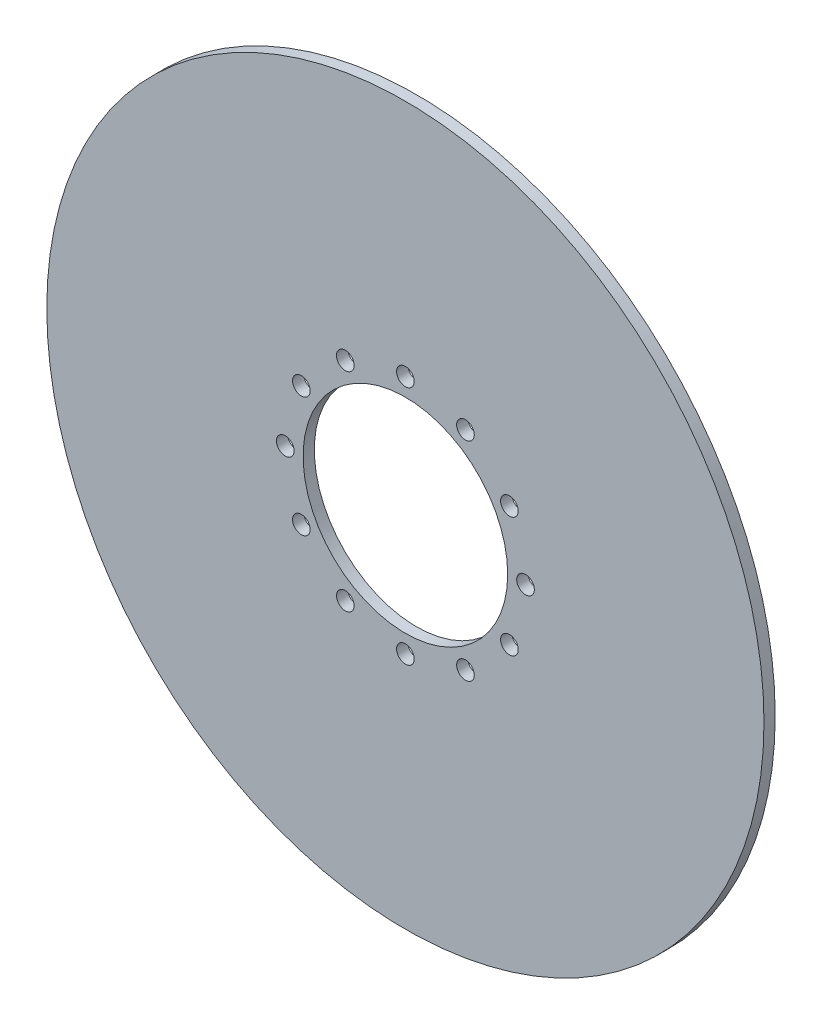
ISO-10303-21;
HEADER;
FILE_DESCRIPTION(('STEP AP214'),'2;1');
FILE_NAME('part.step','',(''),(''),'','','');
FILE_SCHEMA(('AUTOMOTIVE_DESIGN { 1 0 10303 214 1 1 1 1 }'));
ENDSEC;
DATA;
#1=APPLICATION_CONTEXT('core data for automotive mechanical design processes');
#2=APPLICATION_PROTOCOL_DEFINITION('international standard','automotive_design',2000,#1);
#3=PRODUCT_CONTEXT('',#1,'mechanical');
#4=PRODUCT('Part','Part','',(#3));
#5=PRODUCT_RELATED_PRODUCT_CATEGORY('part','',(#4));
#6=PRODUCT_DEFINITION_FORMATION('','',#4);
#7=PRODUCT_DEFINITION_CONTEXT('part definition',#1,'design');
#8=PRODUCT_DEFINITION('design','',#6,#7);
#9=PRODUCT_DEFINITION_SHAPE('','',#8);
#10=(LENGTH_UNIT() NAMED_UNIT(*) SI_UNIT(.MILLI.,.METRE.));
#11=(NAMED_UNIT(*) PLANE_ANGLE_UNIT() SI_UNIT($,.RADIAN.));
#12=(NAMED_UNIT(*) SI_UNIT($,.STERADIAN.) SOLID_ANGLE_UNIT());
#13=UNCERTAINTY_MEASURE_WITH_UNIT(LENGTH_MEASURE(1.E-05),#10,'distance_accuracy_value','');
#14=(GEOMETRIC_REPRESENTATION_CONTEXT(3) GLOBAL_UNCERTAINTY_ASSIGNED_CONTEXT((#13)) GLOBAL_UNIT_ASSIGNED_CONTEXT((#10,
#11,#12)) REPRESENTATION_CONTEXT('',''));
#15=CARTESIAN_POINT('',(0.,0.,0.));
#16=DIRECTION('',(0.,0.,1.));
#17=DIRECTION('',(1.,0.,0.));
#18=AXIS2_PLACEMENT_3D('',#15,#16,#17);
#19=CARTESIAN_POINT('',(0.,0.,3.175));
#20=DIRECTION('',(0.,0.,1.));
#21=DIRECTION('',(1.,0.,0.));
#22=AXIS2_PLACEMENT_3D('',#19,#20,#21);
#23=PLANE('',#22);
#24=CARTESIAN_POINT('',(-29.4448637286702,16.9999999999987,3.175));
#25=DIRECTION('',(0.,0.,1.));
#26=DIRECTION('',(1.,0.,0.));
#27=AXIS2_PLACEMENT_3D('',#24,#25,#26);
#28=CIRCLE('',#27,2.49698906987796);
#29=CARTESIAN_POINT('',(-26.9478746587923,16.9999999999987,3.175));
#30=VERTEX_POINT('',#29);
#31=EDGE_CURVE('E110',#30,#30,#28,.T.);
#32=ORIENTED_EDGE('',*,*,#31,.F.);
#33=EDGE_LOOP('',(#32));
#34=FACE_BOUND('',#33,.T.);
#35=CARTESIAN_POINT('',(-29.4448637286688,-17.0000000000013,3.175));
#36=DIRECTION('',(0.,0.,1.));
#37=DIRECTION('',(1.,0.,0.));
#38=AXIS2_PLACEMENT_3D('',#35,#36,#37);
#39=CIRCLE('',#38,2.49698906987796);
#40=CARTESIAN_POINT('',(-26.9478746587908,-17.0000000000013,3.175));
#41=VERTEX_POINT('',#40);
#42=EDGE_CURVE('E98',#41,#41,#39,.T.);
#43=ORIENTED_EDGE('',*,*,#42,.F.);
#44=EDGE_LOOP('',(#43));
#45=FACE_BOUND('',#44,.T.);
#46=CARTESIAN_POINT('',(2.86804195578331E-12,-34.,3.175));
#47=DIRECTION('',(0.,0.,1.));
#48=DIRECTION('',(1.,0.,0.));
#49=AXIS2_PLACEMENT_3D('',#46,#47,#48);
#50=CIRCLE('',#49,2.49698906987796);
#51=CARTESIAN_POINT('',(2.49698906988083,-34.,3.175));
#52=VERTEX_POINT('',#51);
#53=EDGE_CURVE('E86',#52,#52,#50,.T.);
#54=ORIENTED_EDGE('',*,*,#53,.F.);
#55=EDGE_LOOP('',(#54));
#56=FACE_BOUND('',#55,.T.);
#57=CARTESIAN_POINT('',(29.4448637286731,-16.9999999999988,3.175));
#58=DIRECTION('',(0.,0.,1.));
#59=DIRECTION('',(1.,0.,0.));
#60=AXIS2_PLACEMENT_3D('',#57,#58,#59);
#61=CIRCLE('',#60,2.49698906987769);
#62=CARTESIAN_POINT('',(31.9418527985508,-16.9999999999988,3.175));
#63=VERTEX_POINT('',#62);
#64=EDGE_CURVE('E74',#63,#63,#61,.T.);
#65=ORIENTED_EDGE('',*,*,#64,.F.);
#66=EDGE_LOOP('',(#65));
#67=FACE_BOUND('',#66,.T.);
#68=CARTESIAN_POINT('',(29.4448637286716,17.0000000000012,3.175));
#69=DIRECTION('',(0.,0.,1.));
#70=DIRECTION('',(1.,0.,0.));
#71=AXIS2_PLACEMENT_3D('',#68,#69,#70);
#72=CIRCLE('',#71,2.49698906987796);
#73=CARTESIAN_POINT('',(31.9418527985496,17.0000000000012,3.175));
#74=VERTEX_POINT('',#73);
#75=EDGE_CURVE('E62',#74,#74,#72,.T.);
#76=ORIENTED_EDGE('',*,*,#75,.F.);
#77=EDGE_LOOP('',(#76));
#78=FACE_BOUND('',#77,.T.);
#79=CARTESIAN_POINT('',(0.,34.,3.175));
#80=DIRECTION('',(0.,0.,1.));
#81=DIRECTION('',(1.,0.,0.));
#82=AXIS2_PLACEMENT_3D('',#79,#80,#81);
#83=CIRCLE('',#82,2.49698906987796);
#84=CARTESIAN_POINT('',(2.49698906987796,34.,3.175));
#85=VERTEX_POINT('',#84);
#86=EDGE_CURVE('E50',#85,#85,#83,.T.);
#87=ORIENTED_EDGE('',*,*,#86,.F.);
#88=EDGE_LOOP('',(#87));
#89=FACE_BOUND('',#88,.T.);
#90=CARTESIAN_POINT('',(0.,0.,3.175));
#91=DIRECTION('',(0.,0.,1.));
#92=DIRECTION('',(1.,0.,0.));
#93=AXIS2_PLACEMENT_3D('',#90,#91,#92);
#94=CIRCLE('',#93,101.5);
#95=CARTESIAN_POINT('',(101.5,0.,3.175));
#96=VERTEX_POINT('',#95);
#97=EDGE_CURVE('E10',#96,#96,#94,.T.);
#98=ORIENTED_EDGE('',*,*,#97,.T.);
#99=EDGE_LOOP('',(#98));
#100=FACE_BOUND('',#99,.T.);
#101=CARTESIAN_POINT('',(0.,0.,3.175));
#102=DIRECTION('',(0.,0.,1.));
#103=DIRECTION('',(1.,0.,0.));
#104=AXIS2_PLACEMENT_3D('',#101,#102,#103);
#105=CIRCLE('',#104,28.956);
#106=CARTESIAN_POINT('',(28.956,0.,3.175));
#107=VERTEX_POINT('',#106);
#108=EDGE_CURVE('E45',#107,#107,#105,.T.);
#109=ORIENTED_EDGE('',*,*,#108,.F.);
#110=EDGE_LOOP('',(#109));
#111=FACE_BOUND('',#110,.T.);
#112=CARTESIAN_POINT('',(17.0000000000002,29.4448637286716,3.175));
#113=DIRECTION('',(0.,0.,1.));
#114=DIRECTION('',(1.,0.,0.));
#115=AXIS2_PLACEMENT_3D('',#112,#113,#114);
#116=CIRCLE('',#115,2.49698906987796);
#117=CARTESIAN_POINT('',(19.4969890698782,29.4448637286716,3.175));
#118=VERTEX_POINT('',#117);
#119=EDGE_CURVE('E56',#118,#118,#116,.T.);
#120=ORIENTED_EDGE('',*,*,#119,.F.);
#121=EDGE_LOOP('',(#120));
#122=FACE_BOUND('',#121,.T.);
#123=CARTESIAN_POINT('',(34.0000000000014,1.43402097789165E-12,3.175));
#124=DIRECTION('',(0.,0.,1.));
#125=DIRECTION('',(1.,0.,0.));
#126=AXIS2_PLACEMENT_3D('',#123,#124,#125);
#127=CIRCLE('',#126,2.49698906987796);
#128=CARTESIAN_POINT('',(36.4969890698794,1.43402097789165E-12,3.175));
#129=VERTEX_POINT('',#128);
#130=EDGE_CURVE('E68',#129,#129,#127,.T.);
#131=ORIENTED_EDGE('',*,*,#130,.F.);
#132=EDGE_LOOP('',(#131));
#133=FACE_BOUND('',#132,.T.);
#134=CARTESIAN_POINT('',(17.0000000000027,-29.4448637286702,3.175));
#135=DIRECTION('',(0.,0.,1.));
#136=DIRECTION('',(1.,0.,0.));
#137=AXIS2_PLACEMENT_3D('',#134,#135,#136);
#138=CIRCLE('',#137,2.49698906987837);
#139=CARTESIAN_POINT('',(19.4969890698811,-29.4448637286702,3.175));
#140=VERTEX_POINT('',#139);
#141=EDGE_CURVE('E80',#140,#140,#138,.T.);
#142=ORIENTED_EDGE('',*,*,#141,.F.);
#143=EDGE_LOOP('',(#142));
#144=FACE_BOUND('',#143,.T.);
#145=CARTESIAN_POINT('',(-16.9999999999973,-29.4448637286716,3.175));
#146=DIRECTION('',(0.,0.,1.));
#147=DIRECTION('',(1.,0.,0.));
#148=AXIS2_PLACEMENT_3D('',#145,#146,#147);
#149=CIRCLE('',#148,2.49698906987796);
#150=CARTESIAN_POINT('',(-14.5030109301194,-29.4448637286716,3.175));
#151=VERTEX_POINT('',#150);
#152=EDGE_CURVE('E92',#151,#151,#149,.T.);
#153=ORIENTED_EDGE('',*,*,#152,.F.);
#154=EDGE_LOOP('',(#153));
#155=FACE_BOUND('',#154,.T.);
#156=CARTESIAN_POINT('',(-33.9999999999986,-1.43818477700875E-12,3.175));
#157=DIRECTION('',(0.,0.,1.));
#158=DIRECTION('',(1.,0.,0.));
#159=AXIS2_PLACEMENT_3D('',#156,#157,#158);
#160=CIRCLE('',#159,2.49698906987796);
#161=CARTESIAN_POINT('',(-31.5030109301206,-1.43818477700875E-12,3.175));
#162=VERTEX_POINT('',#161);
#163=EDGE_CURVE('E104',#162,#162,#160,.T.);
#164=ORIENTED_EDGE('',*,*,#163,.F.);
#165=EDGE_LOOP('',(#164));
#166=FACE_BOUND('',#165,.T.);
#167=CARTESIAN_POINT('',(-16.9999999999998,29.4448637286702,3.175));
#168=DIRECTION('',(0.,0.,1.));
#169=DIRECTION('',(1.,0.,0.));
#170=AXIS2_PLACEMENT_3D('',#167,#168,#169);
#171=CIRCLE('',#170,2.49698906987796);
#172=CARTESIAN_POINT('',(-14.5030109301219,29.4448637286702,3.175));
#173=VERTEX_POINT('',#172);
#174=EDGE_CURVE('E116',#173,#173,#171,.T.);
#175=ORIENTED_EDGE('',*,*,#174,.F.);
#176=EDGE_LOOP('',(#175));
#177=FACE_BOUND('',#176,.T.);
#178=ADVANCED_FACE('F34',(#34,#45,#56,#67,#78,#89,#100,#111,#122,#133,#144,#155,#166,#177),#23,.T.);
#179=CARTESIAN_POINT('',(0.,0.,0.));
#180=DIRECTION('',(0.,0.,1.));
#181=DIRECTION('',(1.,0.,0.));
#182=AXIS2_PLACEMENT_3D('',#179,#180,#181);
#183=PLANE('',#182);
#184=CARTESIAN_POINT('',(0.,0.,0.));
#185=DIRECTION('',(0.,0.,1.));
#186=DIRECTION('',(1.,0.,0.));
#187=AXIS2_PLACEMENT_3D('',#184,#185,#186);
#188=CIRCLE('',#187,101.5);
#189=CARTESIAN_POINT('',(101.5,0.,0.));
#190=VERTEX_POINT('',#189);
#191=EDGE_CURVE('E38',#190,#190,#188,.T.);
#192=ORIENTED_EDGE('',*,*,#191,.F.);
#193=EDGE_LOOP('',(#192));
#194=FACE_BOUND('',#193,.T.);
#195=CARTESIAN_POINT('',(0.,0.,0.));
#196=DIRECTION('',(0.,0.,1.));
#197=DIRECTION('',(1.,0.,0.));
#198=AXIS2_PLACEMENT_3D('',#195,#196,#197);
#199=CIRCLE('',#198,28.956);
#200=CARTESIAN_POINT('',(28.956,0.,0.));
#201=VERTEX_POINT('',#200);
#202=EDGE_CURVE('E47',#201,#201,#199,.T.);
#203=ORIENTED_EDGE('',*,*,#202,.T.);
#204=EDGE_LOOP('',(#203));
#205=FACE_BOUND('',#204,.T.);
#206=CARTESIAN_POINT('',(0.,34.,0.));
#207=DIRECTION('',(0.,0.,1.));
#208=DIRECTION('',(1.,0.,0.));
#209=AXIS2_PLACEMENT_3D('',#206,#207,#208);
#210=CIRCLE('',#209,2.49698906987796);
#211=CARTESIAN_POINT('',(2.49698906987796,34.,0.));
#212=VERTEX_POINT('',#211);
#213=EDGE_CURVE('E53',#212,#212,#210,.T.);
#214=ORIENTED_EDGE('',*,*,#213,.T.);
#215=EDGE_LOOP('',(#214));
#216=FACE_BOUND('',#215,.T.);
#217=CARTESIAN_POINT('',(17.0000000000002,29.4448637286716,0.));
#218=DIRECTION('',(0.,0.,1.));
#219=DIRECTION('',(1.,0.,0.));
#220=AXIS2_PLACEMENT_3D('',#217,#218,#219);
#221=CIRCLE('',#220,2.49698906987796);
#222=CARTESIAN_POINT('',(19.4969890698782,29.4448637286716,0.));
#223=VERTEX_POINT('',#222);
#224=EDGE_CURVE('E59',#223,#223,#221,.T.);
#225=ORIENTED_EDGE('',*,*,#224,.T.);
#226=EDGE_LOOP('',(#225));
#227=FACE_BOUND('',#226,.T.);
#228=CARTESIAN_POINT('',(29.4448637286716,17.0000000000012,0.));
#229=DIRECTION('',(0.,0.,1.));
#230=DIRECTION('',(1.,0.,0.));
#231=AXIS2_PLACEMENT_3D('',#228,#229,#230);
#232=CIRCLE('',#231,2.49698906987796);
#233=CARTESIAN_POINT('',(31.9418527985496,17.0000000000012,0.));
#234=VERTEX_POINT('',#233);
#235=EDGE_CURVE('E65',#234,#234,#232,.T.);
#236=ORIENTED_EDGE('',*,*,#235,.T.);
#237=EDGE_LOOP('',(#236));
#238=FACE_BOUND('',#237,.T.);
#239=CARTESIAN_POINT('',(34.0000000000014,1.43402097789165E-12,0.));
#240=DIRECTION('',(0.,0.,1.));
#241=DIRECTION('',(1.,0.,0.));
#242=AXIS2_PLACEMENT_3D('',#239,#240,#241);
#243=CIRCLE('',#242,2.49698906987796);
#244=CARTESIAN_POINT('',(36.4969890698794,1.43402097789165E-12,0.));
#245=VERTEX_POINT('',#244);
#246=EDGE_CURVE('E71',#245,#245,#243,.T.);
#247=ORIENTED_EDGE('',*,*,#246,.T.);
#248=EDGE_LOOP('',(#247));
#249=FACE_BOUND('',#248,.T.);
#250=CARTESIAN_POINT('',(29.4448637286731,-16.9999999999988,0.));
#251=DIRECTION('',(0.,0.,1.));
#252=DIRECTION('',(1.,0.,0.));
#253=AXIS2_PLACEMENT_3D('',#250,#251,#252);
#254=CIRCLE('',#253,2.49698906987769);
#255=CARTESIAN_POINT('',(31.9418527985508,-16.9999999999988,0.));
#256=VERTEX_POINT('',#255);
#257=EDGE_CURVE('E77',#256,#256,#254,.T.);
#258=ORIENTED_EDGE('',*,*,#257,.T.);
#259=EDGE_LOOP('',(#258));
#260=FACE_BOUND('',#259,.T.);
#261=CARTESIAN_POINT('',(17.0000000000027,-29.4448637286702,0.));
#262=DIRECTION('',(0.,0.,1.));
#263=DIRECTION('',(1.,0.,0.));
#264=AXIS2_PLACEMENT_3D('',#261,#262,#263);
#265=CIRCLE('',#264,2.49698906987837);
#266=CARTESIAN_POINT('',(19.4969890698811,-29.4448637286702,0.));
#267=VERTEX_POINT('',#266);
#268=EDGE_CURVE('E83',#267,#267,#265,.T.);
#269=ORIENTED_EDGE('',*,*,#268,.T.);
#270=EDGE_LOOP('',(#269));
#271=FACE_BOUND('',#270,.T.);
#272=CARTESIAN_POINT('',(2.86804195578331E-12,-34.,0.));
#273=DIRECTION('',(0.,0.,1.));
#274=DIRECTION('',(1.,0.,0.));
#275=AXIS2_PLACEMENT_3D('',#272,#273,#274);
#276=CIRCLE('',#275,2.49698906987796);
#277=CARTESIAN_POINT('',(2.49698906988083,-34.,0.));
#278=VERTEX_POINT('',#277);
#279=EDGE_CURVE('E89',#278,#278,#276,.T.);
#280=ORIENTED_EDGE('',*,*,#279,.T.);
#281=EDGE_LOOP('',(#280));
#282=FACE_BOUND('',#281,.T.);
#283=CARTESIAN_POINT('',(-16.9999999999973,-29.4448637286716,0.));
#284=DIRECTION('',(0.,0.,1.));
#285=DIRECTION('',(1.,0.,0.));
#286=AXIS2_PLACEMENT_3D('',#283,#284,#285);
#287=CIRCLE('',#286,2.49698906987796);
#288=CARTESIAN_POINT('',(-14.5030109301194,-29.4448637286716,0.));
#289=VERTEX_POINT('',#288);
#290=EDGE_CURVE('E95',#289,#289,#287,.T.);
#291=ORIENTED_EDGE('',*,*,#290,.T.);
#292=EDGE_LOOP('',(#291));
#293=FACE_BOUND('',#292,.T.);
#294=CARTESIAN_POINT('',(-29.4448637286688,-17.0000000000013,0.));
#295=DIRECTION('',(0.,0.,1.));
#296=DIRECTION('',(1.,0.,0.));
#297=AXIS2_PLACEMENT_3D('',#294,#295,#296);
#298=CIRCLE('',#297,2.49698906987796);
#299=CARTESIAN_POINT('',(-26.9478746587908,-17.0000000000013,0.));
#300=VERTEX_POINT('',#299);
#301=EDGE_CURVE('E101',#300,#300,#298,.T.);
#302=ORIENTED_EDGE('',*,*,#301,.T.);
#303=EDGE_LOOP('',(#302));
#304=FACE_BOUND('',#303,.T.);
#305=CARTESIAN_POINT('',(-33.9999999999986,-1.43818477700875E-12,0.));
#306=DIRECTION('',(0.,0.,1.));
#307=DIRECTION('',(1.,0.,0.));
#308=AXIS2_PLACEMENT_3D('',#305,#306,#307);
#309=CIRCLE('',#308,2.49698906987796);
#310=CARTESIAN_POINT('',(-31.5030109301206,-1.43818477700875E-12,0.));
#311=VERTEX_POINT('',#310);
#312=EDGE_CURVE('E107',#311,#311,#309,.T.);
#313=ORIENTED_EDGE('',*,*,#312,.T.);
#314=EDGE_LOOP('',(#313));
#315=FACE_BOUND('',#314,.T.);
#316=CARTESIAN_POINT('',(-29.4448637286702,16.9999999999987,0.));
#317=DIRECTION('',(0.,0.,1.));
#318=DIRECTION('',(1.,0.,0.));
#319=AXIS2_PLACEMENT_3D('',#316,#317,#318);
#320=CIRCLE('',#319,2.49698906987796);
#321=CARTESIAN_POINT('',(-26.9478746587923,16.9999999999987,0.));
#322=VERTEX_POINT('',#321);
#323=EDGE_CURVE('E113',#322,#322,#320,.T.);
#324=ORIENTED_EDGE('',*,*,#323,.T.);
#325=EDGE_LOOP('',(#324));
#326=FACE_BOUND('',#325,.T.);
#327=CARTESIAN_POINT('',(-16.9999999999998,29.4448637286702,0.));
#328=DIRECTION('',(0.,0.,1.));
#329=DIRECTION('',(1.,0.,0.));
#330=AXIS2_PLACEMENT_3D('',#327,#328,#329);
#331=CIRCLE('',#330,2.49698906987796);
#332=CARTESIAN_POINT('',(-14.5030109301219,29.4448637286702,0.));
#333=VERTEX_POINT('',#332);
#334=EDGE_CURVE('E119',#333,#333,#331,.T.);
#335=ORIENTED_EDGE('',*,*,#334,.T.);
#336=EDGE_LOOP('',(#335));
#337=FACE_BOUND('',#336,.T.);
#338=ADVANCED_FACE('F129',(#194,#205,#216,#227,#238,#249,#260,#271,#282,#293,#304,#315,#326,
#337),#183,.F.);
#339=CARTESIAN_POINT('',(0.,0.,3.175));
#340=DIRECTION('',(0.,0.,-1.));
#341=DIRECTION('',(-1.,0.,0.));
#342=AXIS2_PLACEMENT_3D('',#339,#340,#341);
#343=CYLINDRICAL_SURFACE('',#342,101.5);
#344=ORIENTED_EDGE('',*,*,#97,.F.);
#345=EDGE_LOOP('',(#344));
#346=FACE_BOUND('',#345,.T.);
#347=ORIENTED_EDGE('',*,*,#191,.T.);
#348=EDGE_LOOP('',(#347));
#349=FACE_BOUND('',#348,.T.);
#350=ADVANCED_FACE('F36',(#346,#349),#343,.T.);
#351=CARTESIAN_POINT('',(0.,0.,3.175));
#352=DIRECTION('',(0.,0.,-1.));
#353=DIRECTION('',(-1.,0.,0.));
#354=AXIS2_PLACEMENT_3D('',#351,#352,#353);
#355=CYLINDRICAL_SURFACE('',#354,28.956);
#356=ORIENTED_EDGE('',*,*,#108,.T.);
#357=EDGE_LOOP('',(#356));
#358=FACE_BOUND('',#357,.T.);
#359=ORIENTED_EDGE('',*,*,#202,.F.);
#360=EDGE_LOOP('',(#359));
#361=FACE_BOUND('',#360,.T.);
#362=ADVANCED_FACE('F139',(#358,#361),#355,.F.);
#363=CARTESIAN_POINT('',(0.,34.,3.175));
#364=DIRECTION('',(0.,0.,-1.));
#365=DIRECTION('',(-1.,0.,0.));
#366=AXIS2_PLACEMENT_3D('',#363,#364,#365);
#367=CYLINDRICAL_SURFACE('',#366,2.49698906987796);
#368=ORIENTED_EDGE('',*,*,#86,.T.);
#369=EDGE_LOOP('',(#368));
#370=FACE_BOUND('',#369,.T.);
#371=ORIENTED_EDGE('',*,*,#213,.F.);
#372=EDGE_LOOP('',(#371));
#373=FACE_BOUND('',#372,.T.);
#374=ADVANCED_FACE('F142',(#370,#373),#367,.F.);
#375=CARTESIAN_POINT('',(17.0000000000002,29.4448637286716,3.175));
#376=DIRECTION('',(0.,0.,-1.));
#377=DIRECTION('',(-1.,0.,0.));
#378=AXIS2_PLACEMENT_3D('',#375,#376,#377);
#379=CYLINDRICAL_SURFACE('',#378,2.49698906987796);
#380=ORIENTED_EDGE('',*,*,#119,.T.);
#381=EDGE_LOOP('',(#380));
#382=FACE_BOUND('',#381,.T.);
#383=ORIENTED_EDGE('',*,*,#224,.F.);
#384=EDGE_LOOP('',(#383));
#385=FACE_BOUND('',#384,.T.);
#386=ADVANCED_FACE('F146',(#382,#385),#379,.F.);
#387=CARTESIAN_POINT('',(29.4448637286716,17.0000000000012,3.175));
#388=DIRECTION('',(0.,0.,-1.));
#389=DIRECTION('',(-1.,0.,0.));
#390=AXIS2_PLACEMENT_3D('',#387,#388,#389);
#391=CYLINDRICAL_SURFACE('',#390,2.49698906987796);
#392=ORIENTED_EDGE('',*,*,#75,.T.);
#393=EDGE_LOOP('',(#392));
#394=FACE_BOUND('',#393,.T.);
#395=ORIENTED_EDGE('',*,*,#235,.F.);
#396=EDGE_LOOP('',(#395));
#397=FACE_BOUND('',#396,.T.);
#398=ADVANCED_FACE('F150',(#394,#397),#391,.F.);
#399=CARTESIAN_POINT('',(34.0000000000014,1.43402097789165E-12,3.175));
#400=DIRECTION('',(0.,0.,-1.));
#401=DIRECTION('',(-1.,0.,0.));
#402=AXIS2_PLACEMENT_3D('',#399,#400,#401);
#403=CYLINDRICAL_SURFACE('',#402,2.49698906987796);
#404=ORIENTED_EDGE('',*,*,#130,.T.);
#405=EDGE_LOOP('',(#404));
#406=FACE_BOUND('',#405,.T.);
#407=ORIENTED_EDGE('',*,*,#246,.F.);
#408=EDGE_LOOP('',(#407));
#409=FACE_BOUND('',#408,.T.);
#410=ADVANCED_FACE('F154',(#406,#409),#403,.F.);
#411=CARTESIAN_POINT('',(29.4448637286731,-16.9999999999988,3.175));
#412=DIRECTION('',(0.,0.,-1.));
#413=DIRECTION('',(-1.,0.,0.));
#414=AXIS2_PLACEMENT_3D('',#411,#412,#413);
#415=CYLINDRICAL_SURFACE('',#414,2.49698906987769);
#416=ORIENTED_EDGE('',*,*,#64,.T.);
#417=EDGE_LOOP('',(#416));
#418=FACE_BOUND('',#417,.T.);
#419=ORIENTED_EDGE('',*,*,#257,.F.);
#420=EDGE_LOOP('',(#419));
#421=FACE_BOUND('',#420,.T.);
#422=ADVANCED_FACE('F158',(#418,#421),#415,.F.);
#423=CARTESIAN_POINT('',(17.0000000000027,-29.4448637286702,3.175));
#424=DIRECTION('',(0.,0.,-1.));
#425=DIRECTION('',(-1.,0.,0.));
#426=AXIS2_PLACEMENT_3D('',#423,#424,#425);
#427=CYLINDRICAL_SURFACE('',#426,2.49698906987837);
#428=ORIENTED_EDGE('',*,*,#141,.T.);
#429=EDGE_LOOP('',(#428));
#430=FACE_BOUND('',#429,.T.);
#431=ORIENTED_EDGE('',*,*,#268,.F.);
#432=EDGE_LOOP('',(#431));
#433=FACE_BOUND('',#432,.T.);
#434=ADVANCED_FACE('F162',(#430,#433),#427,.F.);
#435=CARTESIAN_POINT('',(2.86804195578331E-12,-34.,3.175));
#436=DIRECTION('',(0.,0.,-1.));
#437=DIRECTION('',(-1.,0.,0.));
#438=AXIS2_PLACEMENT_3D('',#435,#436,#437);
#439=CYLINDRICAL_SURFACE('',#438,2.49698906987796);
#440=ORIENTED_EDGE('',*,*,#53,.T.);
#441=EDGE_LOOP('',(#440));
#442=FACE_BOUND('',#441,.T.);
#443=ORIENTED_EDGE('',*,*,#279,.F.);
#444=EDGE_LOOP('',(#443));
#445=FACE_BOUND('',#444,.T.);
#446=ADVANCED_FACE('F166',(#442,#445),#439,.F.);
#447=CARTESIAN_POINT('',(-16.9999999999973,-29.4448637286716,3.175));
#448=DIRECTION('',(0.,0.,-1.));
#449=DIRECTION('',(-1.,0.,0.));
#450=AXIS2_PLACEMENT_3D('',#447,#448,#449);
#451=CYLINDRICAL_SURFACE('',#450,2.49698906987796);
#452=ORIENTED_EDGE('',*,*,#152,.T.);
#453=EDGE_LOOP('',(#452));
#454=FACE_BOUND('',#453,.T.);
#455=ORIENTED_EDGE('',*,*,#290,.F.);
#456=EDGE_LOOP('',(#455));
#457=FACE_BOUND('',#456,.T.);
#458=ADVANCED_FACE('F170',(#454,#457),#451,.F.);
#459=CARTESIAN_POINT('',(-29.4448637286688,-17.0000000000013,3.175));
#460=DIRECTION('',(0.,0.,-1.));
#461=DIRECTION('',(-1.,0.,0.));
#462=AXIS2_PLACEMENT_3D('',#459,#460,#461);
#463=CYLINDRICAL_SURFACE('',#462,2.49698906987796);
#464=ORIENTED_EDGE('',*,*,#42,.T.);
#465=EDGE_LOOP('',(#464));
#466=FACE_BOUND('',#465,.T.);
#467=ORIENTED_EDGE('',*,*,#301,.F.);
#468=EDGE_LOOP('',(#467));
#469=FACE_BOUND('',#468,.T.);
#470=ADVANCED_FACE('F174',(#466,#469),#463,.F.);
#471=CARTESIAN_POINT('',(-33.9999999999986,-1.43818477700875E-12,3.175));
#472=DIRECTION('',(0.,0.,-1.));
#473=DIRECTION('',(-1.,0.,0.));
#474=AXIS2_PLACEMENT_3D('',#471,#472,#473);
#475=CYLINDRICAL_SURFACE('',#474,2.49698906987796);
#476=ORIENTED_EDGE('',*,*,#163,.T.);
#477=EDGE_LOOP('',(#476));
#478=FACE_BOUND('',#477,.T.);
#479=ORIENTED_EDGE('',*,*,#312,.F.);
#480=EDGE_LOOP('',(#479));
#481=FACE_BOUND('',#480,.T.);
#482=ADVANCED_FACE('F178',(#478,#481),#475,.F.);
#483=CARTESIAN_POINT('',(-29.4448637286702,16.9999999999987,3.175));
#484=DIRECTION('',(0.,0.,-1.));
#485=DIRECTION('',(-1.,0.,0.));
#486=AXIS2_PLACEMENT_3D('',#483,#484,#485);
#487=CYLINDRICAL_SURFACE('',#486,2.49698906987796);
#488=ORIENTED_EDGE('',*,*,#31,.T.);
#489=EDGE_LOOP('',(#488));
#490=FACE_BOUND('',#489,.T.);
#491=ORIENTED_EDGE('',*,*,#323,.F.);
#492=EDGE_LOOP('',(#491));
#493=FACE_BOUND('',#492,.T.);
#494=ADVANCED_FACE('F182',(#490,#493),#487,.F.);
#495=CARTESIAN_POINT('',(-16.9999999999998,29.4448637286702,3.175));
#496=DIRECTION('',(0.,0.,-1.));
#497=DIRECTION('',(-1.,0.,0.));
#498=AXIS2_PLACEMENT_3D('',#495,#496,#497);
#499=CYLINDRICAL_SURFACE('',#498,2.49698906987796);
#500=ORIENTED_EDGE('',*,*,#174,.T.);
#501=EDGE_LOOP('',(#500));
#502=FACE_BOUND('',#501,.T.);
#503=ORIENTED_EDGE('',*,*,#334,.F.);
#504=EDGE_LOOP('',(#503));
#505=FACE_BOUND('',#504,.T.);
#506=ADVANCED_FACE('F125',(#502,#505),#499,.F.);
#507=CLOSED_SHELL('',(#178,#338,#350,#362,#374,#386,#398,#410,#422,#434,#446,#458,#470,#482,
#494,#506));
#508=MANIFOLD_SOLID_BREP('B2',#507);
#509=ADVANCED_BREP_SHAPE_REPRESENTATION('',(#18,#508),#14);
#510=SHAPE_DEFINITION_REPRESENTATION(#9,#509);
ENDSEC;
END-ISO-10303-21;
